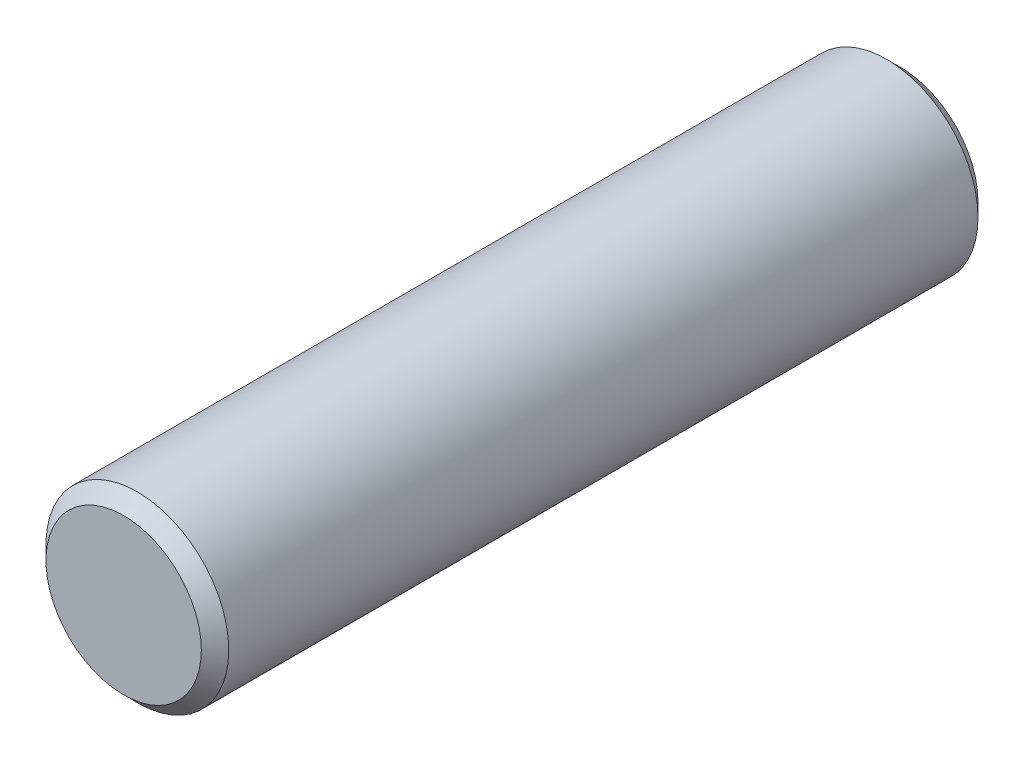
ISO-10303-21;
HEADER;
FILE_DESCRIPTION(('STEP AP214'),'2;1');
FILE_NAME('part.step','',(''),(''),'','','');
FILE_SCHEMA(('AUTOMOTIVE_DESIGN { 1 0 10303 214 1 1 1 1 }'));
ENDSEC;
DATA;
#1=APPLICATION_CONTEXT('core data for automotive mechanical design processes');
#2=APPLICATION_PROTOCOL_DEFINITION('international standard','automotive_design',2000,#1);
#3=PRODUCT_CONTEXT('',#1,'mechanical');
#4=PRODUCT('Part','Part','',(#3));
#5=PRODUCT_RELATED_PRODUCT_CATEGORY('part','',(#4));
#6=PRODUCT_DEFINITION_FORMATION('','',#4);
#7=PRODUCT_DEFINITION_CONTEXT('part definition',#1,'design');
#8=PRODUCT_DEFINITION('design','',#6,#7);
#9=PRODUCT_DEFINITION_SHAPE('','',#8);
#10=(LENGTH_UNIT() NAMED_UNIT(*) SI_UNIT(.MILLI.,.METRE.));
#11=(NAMED_UNIT(*) PLANE_ANGLE_UNIT() SI_UNIT($,.RADIAN.));
#12=(NAMED_UNIT(*) SI_UNIT($,.STERADIAN.) SOLID_ANGLE_UNIT());
#13=UNCERTAINTY_MEASURE_WITH_UNIT(LENGTH_MEASURE(1.E-05),#10,'distance_accuracy_value','');
#14=(GEOMETRIC_REPRESENTATION_CONTEXT(3) GLOBAL_UNCERTAINTY_ASSIGNED_CONTEXT((#13)) GLOBAL_UNIT_ASSIGNED_CONTEXT((#10,
#11,#12)) REPRESENTATION_CONTEXT('',''));
#15=CARTESIAN_POINT('',(0.,0.,0.));
#16=DIRECTION('',(0.,0.,1.));
#17=DIRECTION('',(1.,0.,0.));
#18=AXIS2_PLACEMENT_3D('',#15,#16,#17);
#19=CARTESIAN_POINT('',(0.,0.,17.));
#20=DIRECTION('',(0.,0.,-1.));
#21=DIRECTION('',(-1.,0.,0.));
#22=AXIS2_PLACEMENT_3D('',#19,#20,#21);
#23=CYLINDRICAL_SURFACE('',#22,2.);
#24=CARTESIAN_POINT('',(0.,0.,0.300000000000002));
#25=DIRECTION('',(0.,0.,1.));
#26=DIRECTION('',(1.,0.,0.));
#27=AXIS2_PLACEMENT_3D('',#24,#25,#26);
#28=CIRCLE('',#27,2.);
#29=CARTESIAN_POINT('',(2.,0.,0.300000000000002));
#30=VERTEX_POINT('',#29);
#31=EDGE_CURVE('E42',#30,#30,#28,.T.);
#32=ORIENTED_EDGE('',*,*,#31,.T.);
#33=EDGE_LOOP('',(#32));
#34=FACE_BOUND('',#33,.T.);
#35=CARTESIAN_POINT('',(0.,0.,16.7));
#36=DIRECTION('',(0.,0.,1.));
#37=DIRECTION('',(1.,0.,0.));
#38=AXIS2_PLACEMENT_3D('',#35,#36,#37);
#39=CIRCLE('',#38,2.);
#40=CARTESIAN_POINT('',(2.,0.,16.7));
#41=VERTEX_POINT('',#40);
#42=EDGE_CURVE('E46',#41,#41,#39,.F.);
#43=ORIENTED_EDGE('',*,*,#42,.T.);
#44=EDGE_LOOP('',(#43));
#45=FACE_BOUND('',#44,.T.);
#46=ADVANCED_FACE('F31',(#34,#45),#23,.T.);
#47=CARTESIAN_POINT('',(0.,0.,17.));
#48=DIRECTION('',(0.,0.,1.));
#49=DIRECTION('',(1.,0.,0.));
#50=AXIS2_PLACEMENT_3D('',#47,#48,#49);
#51=PLANE('',#50);
#52=CARTESIAN_POINT('',(0.,0.,17.));
#53=DIRECTION('',(0.,0.,1.));
#54=DIRECTION('',(1.,0.,0.));
#55=AXIS2_PLACEMENT_3D('',#52,#53,#54);
#56=CIRCLE('',#55,1.69999999999999);
#57=CARTESIAN_POINT('',(1.69999999999999,0.,17.));
#58=VERTEX_POINT('',#57);
#59=EDGE_CURVE('E10',#58,#58,#56,.T.);
#60=ORIENTED_EDGE('',*,*,#59,.T.);
#61=EDGE_LOOP('',(#60));
#62=FACE_BOUND('',#61,.T.);
#63=ADVANCED_FACE('F62',(#62),#51,.T.);
#64=CARTESIAN_POINT('',(0.,0.,0.));
#65=DIRECTION('',(0.,0.,1.));
#66=DIRECTION('',(1.,0.,0.));
#67=AXIS2_PLACEMENT_3D('',#64,#65,#66);
#68=PLANE('',#67);
#69=CARTESIAN_POINT('',(0.,0.,0.));
#70=DIRECTION('',(0.,0.,1.));
#71=DIRECTION('',(1.,0.,0.));
#72=AXIS2_PLACEMENT_3D('',#69,#70,#71);
#73=CIRCLE('',#72,1.7);
#74=CARTESIAN_POINT('',(1.7,0.,0.));
#75=VERTEX_POINT('',#74);
#76=EDGE_CURVE('E38',#75,#75,#73,.F.);
#77=ORIENTED_EDGE('',*,*,#76,.T.);
#78=EDGE_LOOP('',(#77));
#79=FACE_BOUND('',#78,.T.);
#80=ADVANCED_FACE('F59',(#79),#68,.F.);
#81=CARTESIAN_POINT('',(0.,0.,0.300000000000002));
#82=DIRECTION('',(0.,0.,1.));
#83=DIRECTION('',(1.,0.,0.));
#84=AXIS2_PLACEMENT_3D('',#81,#82,#83);
#85=CONICAL_SURFACE('',#84,2.,0.785398163397448);
#86=ORIENTED_EDGE('',*,*,#76,.F.);
#87=EDGE_LOOP('',(#86));
#88=FACE_BOUND('',#87,.T.);
#89=ORIENTED_EDGE('',*,*,#31,.F.);
#90=EDGE_LOOP('',(#89));
#91=FACE_BOUND('',#90,.T.);
#92=ADVANCED_FACE('F55',(#88,#91),#85,.T.);
#93=CARTESIAN_POINT('',(0.,0.,17.));
#94=DIRECTION('',(0.,0.,-1.));
#95=DIRECTION('',(-1.,0.,0.));
#96=AXIS2_PLACEMENT_3D('',#93,#94,#95);
#97=CONICAL_SURFACE('',#96,1.69999999999999,0.785398163397448);
#98=ORIENTED_EDGE('',*,*,#42,.F.);
#99=EDGE_LOOP('',(#98));
#100=FACE_BOUND('',#99,.T.);
#101=ORIENTED_EDGE('',*,*,#59,.F.);
#102=EDGE_LOOP('',(#101));
#103=FACE_BOUND('',#102,.T.);
#104=ADVANCED_FACE('F33',(#100,#103),#97,.T.);
#105=CLOSED_SHELL('',(#46,#63,#80,#92,#104));
#106=MANIFOLD_SOLID_BREP('B2',#105);
#107=ADVANCED_BREP_SHAPE_REPRESENTATION('',(#18,#106),#14);
#108=SHAPE_DEFINITION_REPRESENTATION(#9,#107);
ENDSEC;
END-ISO-10303-21;
